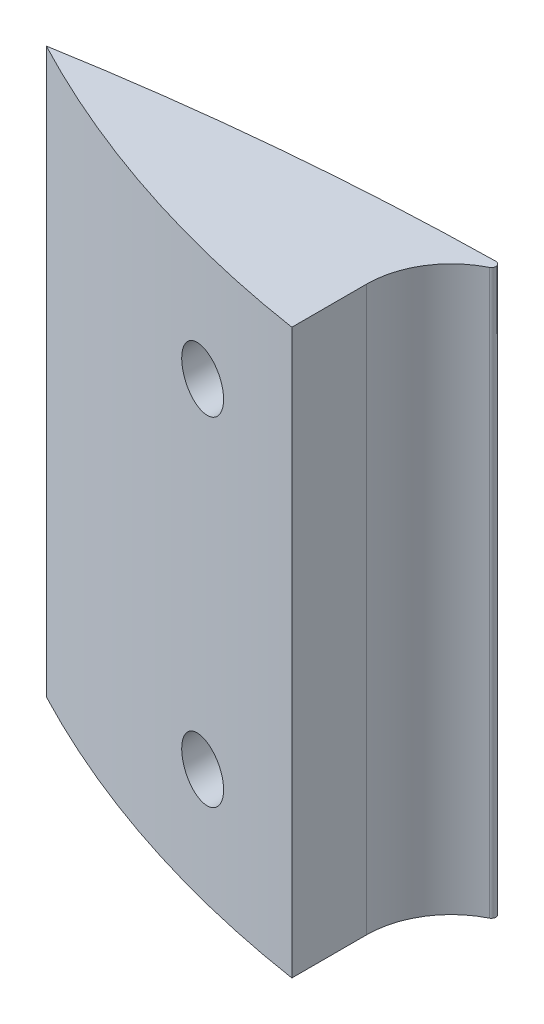
ISO-10303-21;
HEADER;
FILE_DESCRIPTION(('STEP AP214'),'2;1');
FILE_NAME('part.step','',(''),(''),'','','');
FILE_SCHEMA(('AUTOMOTIVE_DESIGN { 1 0 10303 214 1 1 1 1 }'));
ENDSEC;
DATA;
#1=APPLICATION_CONTEXT('core data for automotive mechanical design processes');
#2=APPLICATION_PROTOCOL_DEFINITION('international standard','automotive_design',2000,#1);
#3=PRODUCT_CONTEXT('',#1,'mechanical');
#4=PRODUCT('Part','Part','',(#3));
#5=PRODUCT_RELATED_PRODUCT_CATEGORY('part','',(#4));
#6=PRODUCT_DEFINITION_FORMATION('','',#4);
#7=PRODUCT_DEFINITION_CONTEXT('part definition',#1,'design');
#8=PRODUCT_DEFINITION('design','',#6,#7);
#9=PRODUCT_DEFINITION_SHAPE('','',#8);
#10=(LENGTH_UNIT() NAMED_UNIT(*) SI_UNIT(.MILLI.,.METRE.));
#11=(NAMED_UNIT(*) PLANE_ANGLE_UNIT() SI_UNIT($,.RADIAN.));
#12=(NAMED_UNIT(*) SI_UNIT($,.STERADIAN.) SOLID_ANGLE_UNIT());
#13=UNCERTAINTY_MEASURE_WITH_UNIT(LENGTH_MEASURE(1.E-05),#10,'distance_accuracy_value','');
#14=(GEOMETRIC_REPRESENTATION_CONTEXT(3) GLOBAL_UNCERTAINTY_ASSIGNED_CONTEXT((#13)) GLOBAL_UNIT_ASSIGNED_CONTEXT((#10,
#11,#12)) REPRESENTATION_CONTEXT('',''));
#15=CARTESIAN_POINT('',(0.,0.,0.));
#16=DIRECTION('',(0.,0.,1.));
#17=DIRECTION('',(1.,0.,0.));
#18=AXIS2_PLACEMENT_3D('',#15,#16,#17);
#19=CARTESIAN_POINT('',(-2.23370309297084,31.75,-148.954252747253));
#20=DIRECTION('',(0.,-1.,0.));
#21=DIRECTION('',(0.,0.,-1.));
#22=AXIS2_PLACEMENT_3D('',#19,#20,#21);
#23=CYLINDRICAL_SURFACE('',#22,0.253999999999995);
#24=CARTESIAN_POINT('',(-2.23370309297084,0.,-148.954252747253));
#25=DIRECTION('',(0.,1.,0.));
#26=DIRECTION('',(0.,0.,1.));
#27=AXIS2_PLACEMENT_3D('',#24,#25,#26);
#28=CIRCLE('',#27,0.253999999999995);
#29=CARTESIAN_POINT('',(-2.23751162339361,0.,-149.208224192687));
#30=VERTEX_POINT('',#29);
#31=CARTESIAN_POINT('',(-2.12060420218751,0.,-148.726822228405));
#32=VERTEX_POINT('',#31);
#33=EDGE_CURVE('E119',#30,#32,#28,.F.);
#34=ORIENTED_EDGE('',*,*,#33,.F.);
#35=DIRECTION('',(0.,-1.,0.));
#36=VECTOR('',#35,1.);
#37=CARTESIAN_POINT('',(-2.23751162339361,31.75,-149.208224192687));
#38=LINE('',#37,#36);
#39=CARTESIAN_POINT('',(-2.23751162339361,31.75,-149.208224192687));
#40=VERTEX_POINT('',#39);
#41=EDGE_CURVE('E11',#40,#30,#38,.T.);
#42=ORIENTED_EDGE('',*,*,#41,.F.);
#43=CARTESIAN_POINT('',(-2.23370309297084,31.75,-148.954252747253));
#44=DIRECTION('',(0.,1.,0.));
#45=DIRECTION('',(0.,0.,1.));
#46=AXIS2_PLACEMENT_3D('',#43,#44,#45);
#47=CIRCLE('',#46,0.253999999999995);
#48=CARTESIAN_POINT('',(-2.12060420218751,31.75,-148.726822228405));
#49=VERTEX_POINT('',#48);
#50=EDGE_CURVE('E130',#40,#49,#47,.F.);
#51=ORIENTED_EDGE('',*,*,#50,.T.);
#52=DIRECTION('',(0.,-1.,0.));
#53=VECTOR('',#52,1.);
#54=CARTESIAN_POINT('',(-2.12060420218751,31.75,-148.726822228405));
#55=LINE('',#54,#53);
#56=EDGE_CURVE('E61',#49,#32,#55,.T.);
#57=ORIENTED_EDGE('',*,*,#56,.T.);
#58=EDGE_LOOP('',(#34,#42,#51,#57));
#59=FACE_BOUND('',#58,.T.);
#60=ADVANCED_FACE('F38',(#59),#23,.T.);
#61=CARTESIAN_POINT('',(0.,31.75,0.));
#62=DIRECTION('',(0.,-1.,0.));
#63=DIRECTION('',(0.,0.,-1.));
#64=AXIS2_PLACEMENT_3D('',#61,#62,#63);
#65=CYLINDRICAL_SURFACE('',#64,149.225);
#66=CARTESIAN_POINT('',(-12.7,25.4,-148.683592319395));
#67=CARTESIAN_POINT('',(-12.6999960164895,25.3110613100668,-148.683592731785));
#68=CARTESIAN_POINT('',(-12.6925003578211,25.2220580576522,-148.684233501385));
#69=CARTESIAN_POINT('',(-12.6627077070845,25.0465075600435,-148.686773700128));
#70=CARTESIAN_POINT('',(-12.6403929029256,24.9599634012913,-148.688674643951));
#71=CARTESIAN_POINT('',(-12.5816129719879,24.7919045496928,-148.693659935041));
#72=CARTESIAN_POINT('',(-12.5451557840817,24.7103870648087,-148.696743618363));
#73=CARTESIAN_POINT('',(-12.4591506358712,24.554659898861,-148.703974538911));
#74=CARTESIAN_POINT('',(-12.4096058156383,24.4804484707348,-148.708121521016));
#75=CARTESIAN_POINT('',(-12.2987367819407,24.3412607094112,-148.717331838405));
#76=CARTESIAN_POINT('',(-12.2373911653536,24.276301535418,-148.72239683772));
#77=CARTESIAN_POINT('',(-12.1047239301826,24.1575943518419,-148.733253524956));
#78=CARTESIAN_POINT('',(-12.0334017565161,24.1038469664827,-148.73904525331));
#79=CARTESIAN_POINT('',(-11.8825505835514,24.0089043905248,-148.751172608844));
#80=CARTESIAN_POINT('',(-11.8029951568481,23.9677514103628,-148.757509975765));
#81=CARTESIAN_POINT('',(-11.6381276723458,23.8993881660367,-148.770499227583));
#82=CARTESIAN_POINT('',(-11.5528155344214,23.8721780959838,-148.777151116857));
#83=CARTESIAN_POINT('',(-11.3786206785669,23.8324103114557,-148.790575179587));
#84=CARTESIAN_POINT('',(-11.2897294349641,23.8198900215692,-148.797347615837));
#85=CARTESIAN_POINT('',(-11.1110998446899,23.8099823683153,-148.81079297777));
#86=CARTESIAN_POINT('',(-11.0213614946325,23.8125950654612,-148.817465903054));
#87=CARTESIAN_POINT('',(-10.8435269756261,23.8328931356834,-148.830529474352));
#88=CARTESIAN_POINT('',(-10.7554318687343,23.850587933658,-148.836919941228));
#89=CARTESIAN_POINT('',(-10.5834505677861,23.9005728341597,-148.849248021547));
#90=CARTESIAN_POINT('',(-10.4995643585176,23.932862883931,-148.855185636627));
#91=CARTESIAN_POINT('',(-10.3384986483485,24.0110855077508,-148.86645890759));
#92=CARTESIAN_POINT('',(-10.2613109694812,24.0570011352016,-148.871795299926));
#93=CARTESIAN_POINT('',(-10.1157370356323,24.1611974734049,-148.881757852007));
#94=CARTESIAN_POINT('',(-10.0473506795475,24.2194780420974,-148.886384019911));
#95=CARTESIAN_POINT('',(-9.92148655464047,24.3466117955667,-148.89482431851));
#96=CARTESIAN_POINT('',(-9.86398484978249,24.4154411646991,-148.89864023331));
#97=CARTESIAN_POINT('',(-9.76135495170312,24.5618158879091,-148.905403623862));
#98=CARTESIAN_POINT('',(-9.7162266107262,24.6393611378912,-148.908351109986));
#99=CARTESIAN_POINT('',(-9.63972893967632,24.8007826255233,-148.913322857347));
#100=CARTESIAN_POINT('',(-9.60832960027975,24.8846445803848,-148.915349132588));
#101=CARTESIAN_POINT('',(-9.56004932505922,25.0564650855552,-148.918456452651));
#102=CARTESIAN_POINT('',(-9.54316825617883,25.1444235983123,-148.919537506136));
#103=CARTESIAN_POINT('',(-9.524424592408,25.3218023809712,-148.920737478553));
#104=CARTESIAN_POINT('',(-9.52254006082342,25.4112203239668,-148.920857802826));
#105=CARTESIAN_POINT('',(-9.53378582502585,25.5891028107723,-148.920138273511));
#106=CARTESIAN_POINT('',(-9.54691605935787,25.6775673584828,-148.919298423853));
#107=CARTESIAN_POINT('',(-9.58780555085147,25.8509959365089,-148.916671413411));
#108=CARTESIAN_POINT('',(-9.61555896730573,25.9359613498309,-148.914884630844));
#109=CARTESIAN_POINT('',(-9.6848948820682,26.1000219885918,-148.910391296533));
#110=CARTESIAN_POINT('',(-9.726477401898,26.179117204895,-148.907684743357));
#111=CARTESIAN_POINT('',(-9.82231636209529,26.3292578085678,-148.901393631298));
#112=CARTESIAN_POINT('',(-9.87658208429901,26.4002972437261,-148.897808429307));
#113=CARTESIAN_POINT('',(-9.99621968447313,26.5322572059918,-148.889824372772));
#114=CARTESIAN_POINT('',(-10.0615916511138,26.5931776523033,-148.885425511731));
#115=CARTESIAN_POINT('',(-10.2017015600812,26.7032861464014,-148.875890726996));
#116=CARTESIAN_POINT('',(-10.2764555039488,26.7524537225786,-148.870753541817));
#117=CARTESIAN_POINT('',(-10.433113231392,26.8375450376541,-148.859856679568));
#118=CARTESIAN_POINT('',(-10.5150170940812,26.873468629985,-148.85409699561));
#119=CARTESIAN_POINT('',(-10.6838483059351,26.9311399674858,-148.842074638762));
#120=CARTESIAN_POINT('',(-10.7707867454839,26.9528550118687,-148.83581084258));
#121=CARTESIAN_POINT('',(-10.947051849844,26.9813773199184,-148.822950135066));
#122=CARTESIAN_POINT('',(-11.0363785499507,26.9881843631406,-148.816353218809));
#123=CARTESIAN_POINT('',(-11.2150787625173,26.9867054055736,-148.802992838372));
#124=CARTESIAN_POINT('',(-11.3044519967225,26.9783884911321,-148.796229061007));
#125=CARTESIAN_POINT('',(-11.4805300067264,26.9468387255381,-148.782747170686));
#126=CARTESIAN_POINT('',(-11.5672347573472,26.9236057336926,-148.776029058162));
#127=CARTESIAN_POINT('',(-11.7355840517839,26.8628523054466,-148.762844260204));
#128=CARTESIAN_POINT('',(-11.8172245622235,26.8253206466449,-148.756377776668));
#129=CARTESIAN_POINT('',(-11.9730431483299,26.7370265426733,-148.743917453881));
#130=CARTESIAN_POINT('',(-12.0472215416076,26.6862646609533,-148.737923594514));
#131=CARTESIAN_POINT('',(-12.1859044859718,26.5730146787027,-148.72662572677));
#132=CARTESIAN_POINT('',(-12.2504217914017,26.5105422880527,-148.721320810116));
#133=CARTESIAN_POINT('',(-12.3680614869332,26.375569596773,-148.711583860971));
#134=CARTESIAN_POINT('',(-12.4211812052949,26.3030669514605,-148.707152033162));
#135=CARTESIAN_POINT('',(-12.5143509644851,26.1503054768677,-148.699340389896));
#136=CARTESIAN_POINT('',(-12.5544329100226,26.070066213915,-148.695958007294));
#137=CARTESIAN_POINT('',(-12.6205066518632,25.9040213532925,-148.690364674327));
#138=CARTESIAN_POINT('',(-12.6465157120108,25.8182227209722,-148.688152288749));
#139=CARTESIAN_POINT('',(-12.6767151589905,25.6765558265919,-148.68557980712));
#140=CARTESIAN_POINT('',(-12.6854358477429,25.6216189917021,-148.684835733336));
#141=CARTESIAN_POINT('',(-12.6970795068442,25.5111298408232,-148.683841861138));
#142=CARTESIAN_POINT('',(-12.700002489284,25.4555775261179,-148.683592061693));
#143=CARTESIAN_POINT('',(-12.7,25.4,-148.683592319395));
#144=B_SPLINE_CURVE_WITH_KNOTS('',3,(#66,#67,#68,#69,#70,#71,#72,#73,#74,#75,#76,#77,#78,#79,
#80,#81,#82,#83,#84,#85,#86,#87,#88,#89,#90,#91,#92,#93,#94,#95,#96,#97,#98,#99,#100,#101,#102,
#103,#104,#105,#106,#107,#108,#109,#110,#111,#112,#113,#114,#115,#116,#117,#118,#119,#120,#121,
#122,#123,#124,#125,#126,#127,#128,#129,#130,#131,#132,#133,#134,#135,#136,#137,#138,#139,#140,
#141,#142,#143),.UNSPECIFIED.,.T.,.F.,(4,2,2,2,2,2,2,2,2,2,2,2,2,2,2,2,2,2,2,2,2,2,2,2,2,2,2,2,
2,2,2,2,2,2,2,2,2,2,4),(0.,0.266612806593436,0.533546653801418,0.800330873168733,
1.06705114194267,1.33425980209982,1.60148333531149,1.86959290641726,2.13770621000229,
2.40650110248235,2.67529706981261,2.94426113266399,3.21322422333127,3.48185418748935,
3.75048106554259,4.01851017319166,4.28653608005301,4.55397316161735,4.82140779215949,
5.08845115157303,5.35549341798988,5.62242910468377,5.88936520679901,6.15649727348155,
6.42363147299801,6.6912276409137,6.95882677015251,7.227039629007,7.49525645389786,
7.76402213536554,8.03279035195186,8.30176994903528,8.57073809266259,8.83934795951531,
9.10802072332378,9.37603098386935,9.64371171437285,9.81031762159361,9.97692318136682),.UNSPECIFIED.);
#145=CARTESIAN_POINT('',(-12.7,25.4,-148.683592319395));
#146=VERTEX_POINT('',#145);
#147=EDGE_CURVE('E122',#146,#146,#144,.T.);
#148=ORIENTED_EDGE('',*,*,#147,.T.);
#149=EDGE_LOOP('',(#148));
#150=FACE_BOUND('',#149,.T.);
#151=CARTESIAN_POINT('',(-12.7,6.35,-148.683592319395));
#152=CARTESIAN_POINT('',(-12.6999960164895,6.26106131006681,-148.683592731785));
#153=CARTESIAN_POINT('',(-12.6925003578211,6.17205805765219,-148.684233501385));
#154=CARTESIAN_POINT('',(-12.6627077070845,5.99650756004353,-148.686773700128));
#155=CARTESIAN_POINT('',(-12.6403929029256,5.90996340129129,-148.688674643951));
#156=CARTESIAN_POINT('',(-12.5816129719879,5.74190454969284,-148.693659935041));
#157=CARTESIAN_POINT('',(-12.5451557840818,5.66038706480871,-148.696743618363));
#158=CARTESIAN_POINT('',(-12.4591506358712,5.50465989886105,-148.703974538911));
#159=CARTESIAN_POINT('',(-12.4096058156383,5.43044847073478,-148.708121521016));
#160=CARTESIAN_POINT('',(-12.2987367819407,5.29126070941116,-148.717331838405));
#161=CARTESIAN_POINT('',(-12.2373911653537,5.22630153541805,-148.72239683772));
#162=CARTESIAN_POINT('',(-12.1047239301826,5.10759435184187,-148.733253524956));
#163=CARTESIAN_POINT('',(-12.0334017565162,5.05384696648272,-148.73904525331));
#164=CARTESIAN_POINT('',(-11.8825505835514,4.95890439052475,-148.751172608844));
#165=CARTESIAN_POINT('',(-11.8029951568481,4.91775141036276,-148.757509975765));
#166=CARTESIAN_POINT('',(-11.6381276723458,4.84938816603672,-148.770499227583));
#167=CARTESIAN_POINT('',(-11.5528155344215,4.82217809598376,-148.777151116857));
#168=CARTESIAN_POINT('',(-11.3786206785669,4.78241031145566,-148.790575179587));
#169=CARTESIAN_POINT('',(-11.2897294349641,4.76989002156916,-148.797347615837));
#170=CARTESIAN_POINT('',(-11.1110998446899,4.75998236831525,-148.81079297777));
#171=CARTESIAN_POINT('',(-11.0213614946325,4.76259506546121,-148.817465903054));
#172=CARTESIAN_POINT('',(-10.8435269756261,4.78289313568342,-148.830529474352));
#173=CARTESIAN_POINT('',(-10.7554318687343,4.80058793365802,-148.836919941228));
#174=CARTESIAN_POINT('',(-10.5834505677861,4.85057283415965,-148.849248021547));
#175=CARTESIAN_POINT('',(-10.4995643585176,4.88286288393099,-148.855185636627));
#176=CARTESIAN_POINT('',(-10.3384986483485,4.96108550775075,-148.86645890759));
#177=CARTESIAN_POINT('',(-10.2613109694812,5.00700113520161,-148.871795299926));
#178=CARTESIAN_POINT('',(-10.1157370356324,5.11119747340494,-148.881757852007));
#179=CARTESIAN_POINT('',(-10.0473506795475,5.16947804209742,-148.886384019911));
#180=CARTESIAN_POINT('',(-9.92148655464047,5.29661179556674,-148.89482431851));
#181=CARTESIAN_POINT('',(-9.86398484978249,5.36544116469908,-148.89864023331));
#182=CARTESIAN_POINT('',(-9.76135495170313,5.51181588790912,-148.905403623862));
#183=CARTESIAN_POINT('',(-9.7162266107262,5.58936113789122,-148.908351109986));
#184=CARTESIAN_POINT('',(-9.63972893967633,5.75078262552332,-148.913322857347));
#185=CARTESIAN_POINT('',(-9.60832960027975,5.83464458038483,-148.915349132588));
#186=CARTESIAN_POINT('',(-9.56004932505922,6.00646508555521,-148.918456452651));
#187=CARTESIAN_POINT('',(-9.54316825617883,6.09442359831235,-148.919537506136));
#188=CARTESIAN_POINT('',(-9.524424592408,6.27180238097119,-148.920737478553));
#189=CARTESIAN_POINT('',(-9.52254006082342,6.36122032396683,-148.920857802826));
#190=CARTESIAN_POINT('',(-9.53378582502585,6.53910281077227,-148.920138273511));
#191=CARTESIAN_POINT('',(-9.54691605935787,6.62756735848279,-148.919298423853));
#192=CARTESIAN_POINT('',(-9.58780555085147,6.80099593650894,-148.916671413411));
#193=CARTESIAN_POINT('',(-9.61555896730573,6.88596134983087,-148.914884630844));
#194=CARTESIAN_POINT('',(-9.6848948820682,7.05002198859176,-148.910391296533));
#195=CARTESIAN_POINT('',(-9.726477401898,7.12911720489498,-148.907684743357));
#196=CARTESIAN_POINT('',(-9.82231636209529,7.27925780856782,-148.901393631298));
#197=CARTESIAN_POINT('',(-9.87658208429901,7.35029724372614,-148.897808429307));
#198=CARTESIAN_POINT('',(-9.99621968447313,7.48225720599178,-148.889824372772));
#199=CARTESIAN_POINT('',(-10.0615916511138,7.54317765230325,-148.885425511731));
#200=CARTESIAN_POINT('',(-10.2017015600812,7.65328614640137,-148.875890726996));
#201=CARTESIAN_POINT('',(-10.2764555039488,7.70245372257855,-148.870753541817));
#202=CARTESIAN_POINT('',(-10.433113231392,7.78754503765409,-148.859856679568));
#203=CARTESIAN_POINT('',(-10.5150170940812,7.82346862998497,-148.85409699561));
#204=CARTESIAN_POINT('',(-10.6838483059351,7.8811399674858,-148.842074638762));
#205=CARTESIAN_POINT('',(-10.7707867454839,7.90285501186871,-148.83581084258));
#206=CARTESIAN_POINT('',(-10.947051849844,7.9313773199184,-148.822950135066));
#207=CARTESIAN_POINT('',(-11.0363785499507,7.93818436314058,-148.816353218809));
#208=CARTESIAN_POINT('',(-11.2150787625173,7.93670540557363,-148.802992838372));
#209=CARTESIAN_POINT('',(-11.3044519967225,7.92838849113207,-148.796229061007));
#210=CARTESIAN_POINT('',(-11.4805300067264,7.89683872553809,-148.782747170686));
#211=CARTESIAN_POINT('',(-11.5672347573472,7.87360573369259,-148.776029058162));
#212=CARTESIAN_POINT('',(-11.7355840517839,7.81285230544656,-148.762844260204));
#213=CARTESIAN_POINT('',(-11.8172245622235,7.7753206466449,-148.756377776668));
#214=CARTESIAN_POINT('',(-11.9730431483299,7.68702654267332,-148.743917453881));
#215=CARTESIAN_POINT('',(-12.0472215416076,7.63626466095331,-148.737923594514));
#216=CARTESIAN_POINT('',(-12.1859044859718,7.52301467870266,-148.72662572677));
#217=CARTESIAN_POINT('',(-12.2504217914018,7.46054228805267,-148.721320810116));
#218=CARTESIAN_POINT('',(-12.3680614869332,7.32556959677296,-148.711583860971));
#219=CARTESIAN_POINT('',(-12.4211812052949,7.25306695146046,-148.707152033162));
#220=CARTESIAN_POINT('',(-12.5143509644851,7.10030547686768,-148.699340389896));
#221=CARTESIAN_POINT('',(-12.5544329100226,7.02006621391504,-148.695958007294));
#222=CARTESIAN_POINT('',(-12.6205066518632,6.85402135329251,-148.690364674327));
#223=CARTESIAN_POINT('',(-12.6465157120108,6.76822272097218,-148.688152288749));
#224=CARTESIAN_POINT('',(-12.6767151589905,6.62655582659193,-148.68557980712));
#225=CARTESIAN_POINT('',(-12.6854358477429,6.57161899170208,-148.684835733336));
#226=CARTESIAN_POINT('',(-12.6970795068442,6.46112984082317,-148.683841861138));
#227=CARTESIAN_POINT('',(-12.700002489284,6.40557752611791,-148.683592061693));
#228=CARTESIAN_POINT('',(-12.7,6.35,-148.683592319395));
#229=B_SPLINE_CURVE_WITH_KNOTS('',3,(#151,#152,#153,#154,#155,#156,#157,#158,#159,#160,#161,
#162,#163,#164,#165,#166,#167,#168,#169,#170,#171,#172,#173,#174,#175,#176,#177,#178,#179,#180,
#181,#182,#183,#184,#185,#186,#187,#188,#189,#190,#191,#192,#193,#194,#195,#196,#197,#198,#199,
#200,#201,#202,#203,#204,#205,#206,#207,#208,#209,#210,#211,#212,#213,#214,#215,#216,#217,#218,
#219,#220,#221,#222,#223,#224,#225,#226,#227,#228),.UNSPECIFIED.,.T.,.F.,(4,2,2,2,2,2,2,2,2,2,2,
2,2,2,2,2,2,2,2,2,2,2,2,2,2,2,2,2,2,2,2,2,2,2,2,2,2,2,4),(0.,0.266612806593428,
0.533546653801418,0.800330873168733,1.06705114194267,1.33425980209982,1.6014833353115,
1.86959290641726,2.13770621000229,2.40650110248236,2.67529706981262,2.94426113266399,
3.21322422333128,3.48185418748935,3.75048106554259,4.01851017319167,4.28653608005301,
4.55397316161736,4.8214077921595,5.08845115157303,5.35549341798989,5.62242910468377,
5.88936520679902,6.15649727348155,6.42363147299801,6.69122764091371,6.95882677015252,
7.227039629007,7.49525645389787,7.76402213536555,8.03279035195187,8.30176994903529,
8.5707380926626,8.83934795951533,9.10802072332379,9.37603098386936,9.64371171437286,
9.81031762159362,9.97692318136684),.UNSPECIFIED.);
#230=CARTESIAN_POINT('',(-12.7,6.35,-148.683592319395));
#231=VERTEX_POINT('',#230);
#232=EDGE_CURVE('E139',#231,#231,#229,.T.);
#233=ORIENTED_EDGE('',*,*,#232,.T.);
#234=EDGE_LOOP('',(#233));
#235=FACE_BOUND('',#234,.T.);
#236=CARTESIAN_POINT('',(0.,0.,0.));
#237=DIRECTION('',(0.,1.,0.));
#238=DIRECTION('',(0.,0.,1.));
#239=AXIS2_PLACEMENT_3D('',#236,#237,#238);
#240=CIRCLE('',#239,149.225);
#241=CARTESIAN_POINT('',(-25.4,0.,-147.04740944675));
#242=VERTEX_POINT('',#241);
#243=EDGE_CURVE('E121',#30,#242,#240,.T.);
#244=ORIENTED_EDGE('',*,*,#243,.T.);
#245=DIRECTION('',(0.,-1.,0.));
#246=VECTOR('',#245,1.);
#247=CARTESIAN_POINT('',(-25.4,31.75,-147.04740944675));
#248=LINE('',#247,#246);
#249=CARTESIAN_POINT('',(-25.4,31.75,-147.04740944675));
#250=VERTEX_POINT('',#249);
#251=EDGE_CURVE('E52',#250,#242,#248,.T.);
#252=ORIENTED_EDGE('',*,*,#251,.F.);
#253=CARTESIAN_POINT('',(0.,31.75,0.));
#254=DIRECTION('',(0.,1.,0.));
#255=DIRECTION('',(0.,0.,1.));
#256=AXIS2_PLACEMENT_3D('',#253,#254,#255);
#257=CIRCLE('',#256,149.225);
#258=EDGE_CURVE('E100',#40,#250,#257,.T.);
#259=ORIENTED_EDGE('',*,*,#258,.F.);
#260=ORIENTED_EDGE('',*,*,#41,.T.);
#261=EDGE_LOOP('',(#244,#252,#259,#260));
#262=FACE_BOUND('',#261,.T.);
#263=ADVANCED_FACE('F162',(#150,#235,#262),#65,.T.);
#264=CARTESIAN_POINT('',(5.35675243614937,31.75,-205.644198638905));
#265=DIRECTION('',(0.,-1.,0.));
#266=DIRECTION('',(0.,0.,-1.));
#267=AXIS2_PLACEMENT_3D('',#264,#265,#266);
#268=CYLINDRICAL_SURFACE('',#267,66.1782556739638);
#269=CARTESIAN_POINT('',(-12.7,25.4,-141.976976180971));
#270=CARTESIAN_POINT('',(-12.6999957380114,25.4867309205822,-141.976974808637));
#271=CARTESIAN_POINT('',(-12.692863768307,25.5735268057367,-141.974950925327));
#272=CARTESIAN_POINT('',(-12.6645613884638,25.7446794000014,-141.966934413139));
#273=CARTESIAN_POINT('',(-12.6433737266382,25.8290329785206,-141.960936907125));
#274=CARTESIAN_POINT('',(-12.587719062503,25.9927454531191,-141.945232429865));
#275=CARTESIAN_POINT('',(-12.5532697103769,26.072110825449,-141.93553038918));
#276=CARTESIAN_POINT('',(-12.4722314229641,26.2238231307466,-141.912804326159));
#277=CARTESIAN_POINT('',(-12.4256445584409,26.2961712580298,-141.899780870494));
#278=CARTESIAN_POINT('',(-12.3208617512238,26.4332413735193,-141.870642365485));
#279=CARTESIAN_POINT('',(-12.262478962857,26.4978098254826,-141.854477742145));
#280=CARTESIAN_POINT('',(-12.1363577123053,26.6162902395717,-141.81977624719));
#281=CARTESIAN_POINT('',(-12.068617470664,26.6702001700719,-141.801238924421));
#282=CARTESIAN_POINT('',(-11.9231186358953,26.7678441271238,-141.761701411743));
#283=CARTESIAN_POINT('',(-11.845090271568,26.8111503396506,-141.740637264163));
#284=CARTESIAN_POINT('',(-11.6831839252929,26.8840355557465,-141.697274436263));
#285=CARTESIAN_POINT('',(-11.5993049551885,26.9136122339329,-141.674975547529));
#286=CARTESIAN_POINT('',(-11.4253895169529,26.9590284122837,-141.629125788987));
#287=CARTESIAN_POINT('',(-11.3352441930469,26.9744342647184,-141.605557402944));
#288=CARTESIAN_POINT('',(-11.1536237763668,26.9895819639045,-141.558491939456));
#289=CARTESIAN_POINT('',(-11.0621485679219,26.9893224398649,-141.534994868431));
#290=CARTESIAN_POINT('',(-10.8794075299267,26.9730003661019,-141.488469203683));
#291=CARTESIAN_POINT('',(-10.7881550735563,26.956764003749,-141.465448607026));
#292=CARTESIAN_POINT('',(-10.6095452758283,26.9085582122953,-141.420781261487));
#293=CARTESIAN_POINT('',(-10.5221878222968,26.8765892366043,-141.399134473032));
#294=CARTESIAN_POINT('',(-10.3549053721116,26.7980886966779,-141.358020646901));
#295=CARTESIAN_POINT('',(-10.274911303049,26.7517153716225,-141.338532904073));
#296=CARTESIAN_POINT('',(-10.1238199607735,26.645469162471,-141.301992806397));
#297=CARTESIAN_POINT('',(-10.0527215209959,26.5855980513535,-141.284940132174));
#298=CARTESIAN_POINT('',(-9.92339284335688,26.455639047646,-141.254113964748));
#299=CARTESIAN_POINT('',(-9.86488509825783,26.3858443327454,-141.240269087743));
#300=CARTESIAN_POINT('',(-9.76046302135135,26.2369104785245,-141.215678491483));
#301=CARTESIAN_POINT('',(-9.71454665142014,26.1577728544798,-141.204932270644));
#302=CARTESIAN_POINT('',(-9.63794117196749,25.9947451575506,-141.187064048205));
#303=CARTESIAN_POINT('',(-9.60686871435347,25.9110451396401,-141.179850669146));
#304=CARTESIAN_POINT('',(-9.5591544787887,25.7394170263594,-141.168793627684));
#305=CARTESIAN_POINT('',(-9.54251088748958,25.6514894637526,-141.164949541845));
#306=CARTESIAN_POINT('',(-9.52439547853295,25.4757299056117,-141.160766301816));
#307=CARTESIAN_POINT('',(-9.52263626690645,25.3879289947252,-141.160360754525));
#308=CARTESIAN_POINT('',(-9.53359268183013,25.2132871407889,-141.162889896628));
#309=CARTESIAN_POINT('',(-9.54630754207432,25.1264461471636,-141.165824409187));
#310=CARTESIAN_POINT('',(-9.58568514519504,24.9566640601398,-141.174938645713));
#311=CARTESIAN_POINT('',(-9.61227247372725,24.8737044974254,-141.181100823943));
#312=CARTESIAN_POINT('',(-9.67849705411405,24.7134820229741,-141.196514849199));
#313=CARTESIAN_POINT('',(-9.71813465113402,24.6362192619777,-141.205766777946));
#314=CARTESIAN_POINT('',(-9.80966891827751,24.4887413004204,-141.227248928252));
#315=CARTESIAN_POINT('',(-9.86168081583787,24.4186017635256,-141.239507179438));
#316=CARTESIAN_POINT('',(-9.9761624244685,24.2880498170568,-141.266666073854));
#317=CARTESIAN_POINT('',(-10.0386331219884,24.2276383260649,-141.28156696634));
#318=CARTESIAN_POINT('',(-10.1736712251364,24.1168200348419,-141.314016129249));
#319=CARTESIAN_POINT('',(-10.2464294201313,24.0666606809878,-141.331615131186));
#320=CARTESIAN_POINT('',(-10.3988530412582,23.9792301165607,-141.368786777089));
#321=CARTESIAN_POINT('',(-10.4785193935667,23.9419606374846,-141.388359685754));
#322=CARTESIAN_POINT('',(-10.6448076984057,23.8802973545559,-141.429565375516));
#323=CARTESIAN_POINT('',(-10.7315603181405,23.8562837152897,-141.451239862197));
#324=CARTESIAN_POINT('',(-10.9076175618224,23.8232295527261,-141.495620823105));
#325=CARTESIAN_POINT('',(-10.9969225415666,23.8141911274192,-141.518327441474));
#326=CARTESIAN_POINT('',(-11.1777315424808,23.8112074085932,-141.564706840229));
#327=CARTESIAN_POINT('',(-11.2692388943717,23.8176140782168,-141.588389830339));
#328=CARTESIAN_POINT('',(-11.4498526880684,23.846066660549,-141.635540906243));
#329=CARTESIAN_POINT('',(-11.5389589303762,23.8681138686292,-141.659008974074));
#330=CARTESIAN_POINT('',(-11.712936118268,23.9275372765978,-141.705200970245));
#331=CARTESIAN_POINT('',(-11.7977691908122,23.9650301441217,-141.727917781599));
#332=CARTESIAN_POINT('',(-11.9599507839235,24.0544313326149,-141.771666395294));
#333=CARTESIAN_POINT('',(-12.037299901302,24.106338502829,-141.792698331974));
#334=CARTESIAN_POINT('',(-12.1810485430206,24.2223887842084,-141.83203253698));
#335=CARTESIAN_POINT('',(-12.2475918367737,24.2863415637624,-141.850370270976));
#336=CARTESIAN_POINT('',(-12.3689275486804,24.4252954342025,-141.883977748714));
#337=CARTESIAN_POINT('',(-12.4237191129596,24.5002973272438,-141.899247269517));
#338=CARTESIAN_POINT('',(-12.5180627040927,24.6566171098352,-141.92563903638));
#339=CARTESIAN_POINT('',(-12.5580497747686,24.7376527723477,-141.93687930084));
#340=CARTESIAN_POINT('',(-12.6237540918001,24.9056554121291,-141.955392028005));
#341=CARTESIAN_POINT('',(-12.6494930939791,24.9926131175402,-141.962670539748));
#342=CARTESIAN_POINT('',(-12.6783943790223,25.1335433392603,-141.970851649283));
#343=CARTESIAN_POINT('',(-12.686484280623,25.1864756813106,-141.973144269036));
#344=CARTESIAN_POINT('',(-12.6972883547725,25.2929304355627,-141.976206943787));
#345=CARTESIAN_POINT('',(-12.7000026313269,25.3464528363282,-141.976977028242));
#346=CARTESIAN_POINT('',(-12.7,25.4,-141.976976180971));
#347=B_SPLINE_CURVE_WITH_KNOTS('',3,(#269,#270,#271,#272,#273,#274,#275,#276,#277,#278,#279,
#280,#281,#282,#283,#284,#285,#286,#287,#288,#289,#290,#291,#292,#293,#294,#295,#296,#297,#298,
#299,#300,#301,#302,#303,#304,#305,#306,#307,#308,#309,#310,#311,#312,#313,#314,#315,#316,#317,
#318,#319,#320,#321,#322,#323,#324,#325,#326,#327,#328,#329,#330,#331,#332,#333,#334,#335,#336,
#337,#338,#339,#340,#341,#342,#343,#344,#345,#346),.UNSPECIFIED.,.T.,.F.,(4,2,2,2,2,2,2,2,2,2,2,
2,2,2,2,2,2,2,2,2,2,2,2,2,2,2,2,2,2,2,2,2,2,2,2,2,2,2,4),(0.,0.259992941995481,
0.520305586209556,0.780272967539503,1.04019602521749,1.30461449352335,1.56908331426104,
1.84291488420883,2.11679281633073,2.39879722016067,2.68082630068374,2.96595789300285,
3.25108126838607,3.53317702846359,3.81523575589959,4.09023578410817,4.36519127267191,
4.63260014420022,4.89997540423413,5.16217599807892,5.42436271078876,5.68513873404465,
5.94592165509615,6.2092351675266,6.47257352907967,6.74166587712865,7.01079435832856,
7.28728596585377,7.56381630589833,7.8467075531412,8.12962223257693,8.41471425237379,
8.69978351860253,8.98067787471167,9.261592633545,9.53343455984565,9.80486024906836,
9.96538147826934,10.1258996017378),.UNSPECIFIED.);
#348=CARTESIAN_POINT('',(-12.7,25.4,-141.976976180971));
#349=VERTEX_POINT('',#348);
#350=EDGE_CURVE('E41',#349,#349,#347,.T.);
#351=ORIENTED_EDGE('',*,*,#350,.T.);
#352=EDGE_LOOP('',(#351));
#353=FACE_BOUND('',#352,.T.);
#354=CARTESIAN_POINT('',(-12.7,6.35,-141.976976180971));
#355=CARTESIAN_POINT('',(-12.6999957380114,6.43673092058221,-141.976974808637));
#356=CARTESIAN_POINT('',(-12.692863768307,6.52352680573667,-141.974950925327));
#357=CARTESIAN_POINT('',(-12.6645613884638,6.69467940000135,-141.966934413139));
#358=CARTESIAN_POINT('',(-12.6433737266383,6.77903297852061,-141.960936907125));
#359=CARTESIAN_POINT('',(-12.587719062503,6.94274545311909,-141.945232429865));
#360=CARTESIAN_POINT('',(-12.5532697103769,7.02211082544902,-141.93553038918));
#361=CARTESIAN_POINT('',(-12.4722314229641,7.17382313074656,-141.912804326159));
#362=CARTESIAN_POINT('',(-12.4256445584409,7.24617125802976,-141.899780870494));
#363=CARTESIAN_POINT('',(-12.3208617512238,7.38324137351934,-141.870642365485));
#364=CARTESIAN_POINT('',(-12.262478962857,7.44780982548264,-141.854477742145));
#365=CARTESIAN_POINT('',(-12.1363577123053,7.56629023957166,-141.81977624719));
#366=CARTESIAN_POINT('',(-12.068617470664,7.62020017007194,-141.801238924421));
#367=CARTESIAN_POINT('',(-11.9231186358954,7.71784412712377,-141.761701411743));
#368=CARTESIAN_POINT('',(-11.845090271568,7.76115033965056,-141.740637264163));
#369=CARTESIAN_POINT('',(-11.6831839252929,7.83403555574647,-141.697274436263));
#370=CARTESIAN_POINT('',(-11.5993049551885,7.86361223393292,-141.674975547529));
#371=CARTESIAN_POINT('',(-11.4253895169529,7.90902841228372,-141.629125788987));
#372=CARTESIAN_POINT('',(-11.335244193047,7.92443426471837,-141.605557402944));
#373=CARTESIAN_POINT('',(-11.1536237763668,7.93958196390451,-141.558491939456));
#374=CARTESIAN_POINT('',(-11.0621485679219,7.93932243986491,-141.534994868431));
#375=CARTESIAN_POINT('',(-10.8794075299267,7.92300036610194,-141.488469203683));
#376=CARTESIAN_POINT('',(-10.7881550735563,7.90676400374897,-141.465448607026));
#377=CARTESIAN_POINT('',(-10.6095452758283,7.85855821229528,-141.420781261487));
#378=CARTESIAN_POINT('',(-10.5221878222968,7.82658923660431,-141.399134473032));
#379=CARTESIAN_POINT('',(-10.3549053721116,7.74808869667786,-141.358020646901));
#380=CARTESIAN_POINT('',(-10.274911303049,7.7017153716225,-141.338532904073));
#381=CARTESIAN_POINT('',(-10.1238199607735,7.59546916247098,-141.301992806397));
#382=CARTESIAN_POINT('',(-10.0527215209959,7.53559805135353,-141.284940132174));
#383=CARTESIAN_POINT('',(-9.92339284335688,7.40563904764601,-141.254113964748));
#384=CARTESIAN_POINT('',(-9.86488509825783,7.33584433274538,-141.240269087743));
#385=CARTESIAN_POINT('',(-9.76046302135135,7.18691047852447,-141.215678491483));
#386=CARTESIAN_POINT('',(-9.71454665142014,7.10777285447976,-141.204932270644));
#387=CARTESIAN_POINT('',(-9.63794117196749,6.94474515755065,-141.187064048205));
#388=CARTESIAN_POINT('',(-9.60686871435348,6.86104513964007,-141.179850669146));
#389=CARTESIAN_POINT('',(-9.5591544787887,6.68941702635943,-141.168793627684));
#390=CARTESIAN_POINT('',(-9.54251088748958,6.60148946375259,-141.164949541845));
#391=CARTESIAN_POINT('',(-9.52439547853295,6.42572990561169,-141.160766301816));
#392=CARTESIAN_POINT('',(-9.52263626690645,6.33792899472519,-141.160360754525));
#393=CARTESIAN_POINT('',(-9.53359268183014,6.16328714078887,-141.162889896628));
#394=CARTESIAN_POINT('',(-9.54630754207432,6.07644614716358,-141.165824409187));
#395=CARTESIAN_POINT('',(-9.58568514519504,5.90666406013978,-141.174938645713));
#396=CARTESIAN_POINT('',(-9.61227247372725,5.82370449742538,-141.181100823943));
#397=CARTESIAN_POINT('',(-9.67849705411406,5.66348202297414,-141.196514849199));
#398=CARTESIAN_POINT('',(-9.71813465113402,5.58621926197765,-141.205766777946));
#399=CARTESIAN_POINT('',(-9.80966891827751,5.43874130042037,-141.227248928252));
#400=CARTESIAN_POINT('',(-9.86168081583788,5.36860176352557,-141.239507179438));
#401=CARTESIAN_POINT('',(-9.9761624244685,5.23804981705684,-141.266666073854));
#402=CARTESIAN_POINT('',(-10.0386331219884,5.17763832606494,-141.28156696634));
#403=CARTESIAN_POINT('',(-10.1736712251364,5.06682003484187,-141.314016129249));
#404=CARTESIAN_POINT('',(-10.2464294201313,5.01666068098782,-141.331615131186));
#405=CARTESIAN_POINT('',(-10.3988530412582,4.92923011656068,-141.368786777089));
#406=CARTESIAN_POINT('',(-10.4785193935667,4.89196063748459,-141.388359685754));
#407=CARTESIAN_POINT('',(-10.6448076984057,4.83029735455588,-141.429565375516));
#408=CARTESIAN_POINT('',(-10.7315603181405,4.80628371528972,-141.451239862197));
#409=CARTESIAN_POINT('',(-10.9076175618225,4.77322955272607,-141.495620823105));
#410=CARTESIAN_POINT('',(-10.9969225415666,4.76419112741922,-141.518327441474));
#411=CARTESIAN_POINT('',(-11.1777315424808,4.76120740859317,-141.564706840229));
#412=CARTESIAN_POINT('',(-11.2692388943717,4.76761407821679,-141.588389830339));
#413=CARTESIAN_POINT('',(-11.4498526880684,4.79606666054895,-141.635540906243));
#414=CARTESIAN_POINT('',(-11.5389589303762,4.81811386862922,-141.659008974074));
#415=CARTESIAN_POINT('',(-11.712936118268,4.87753727659781,-141.705200970245));
#416=CARTESIAN_POINT('',(-11.7977691908123,4.91503014412174,-141.727917781599));
#417=CARTESIAN_POINT('',(-11.9599507839235,5.00443133261488,-141.771666395294));
#418=CARTESIAN_POINT('',(-12.037299901302,5.05633850282901,-141.792698331974));
#419=CARTESIAN_POINT('',(-12.1810485430206,5.17238878420839,-141.83203253698));
#420=CARTESIAN_POINT('',(-12.2475918367737,5.23634156376241,-141.850370270976));
#421=CARTESIAN_POINT('',(-12.3689275486804,5.37529543420252,-141.883977748714));
#422=CARTESIAN_POINT('',(-12.4237191129596,5.45029732724384,-141.899247269517));
#423=CARTESIAN_POINT('',(-12.5180627040927,5.60661710983517,-141.92563903638));
#424=CARTESIAN_POINT('',(-12.5580497747687,5.6876527723477,-141.93687930084));
#425=CARTESIAN_POINT('',(-12.6237540918001,5.85565541212909,-141.955392028005));
#426=CARTESIAN_POINT('',(-12.6494930939791,5.94261311754021,-141.962670539748));
#427=CARTESIAN_POINT('',(-12.6783943790223,6.08354333926034,-141.970851649283));
#428=CARTESIAN_POINT('',(-12.686484280623,6.13647568131056,-141.973144269036));
#429=CARTESIAN_POINT('',(-12.6972883547725,6.24293043556267,-141.976206943787));
#430=CARTESIAN_POINT('',(-12.7000026313269,6.29645283632818,-141.976977028242));
#431=CARTESIAN_POINT('',(-12.7,6.35,-141.976976180971));
#432=B_SPLINE_CURVE_WITH_KNOTS('',3,(#354,#355,#356,#357,#358,#359,#360,#361,#362,#363,#364,
#365,#366,#367,#368,#369,#370,#371,#372,#373,#374,#375,#376,#377,#378,#379,#380,#381,#382,#383,
#384,#385,#386,#387,#388,#389,#390,#391,#392,#393,#394,#395,#396,#397,#398,#399,#400,#401,#402,
#403,#404,#405,#406,#407,#408,#409,#410,#411,#412,#413,#414,#415,#416,#417,#418,#419,#420,#421,
#422,#423,#424,#425,#426,#427,#428,#429,#430,#431),.UNSPECIFIED.,.T.,.F.,(4,2,2,2,2,2,2,2,2,2,2,
2,2,2,2,2,2,2,2,2,2,2,2,2,2,2,2,2,2,2,2,2,2,2,2,2,2,2,4),(0.,0.259992941995476,
0.520305586209557,0.780272967539498,1.04019602521749,1.30461449352335,1.56908331426104,
1.84291488420883,2.11679281633073,2.39879722016067,2.68082630068375,2.96595789300285,
3.25108126838608,3.53317702846359,3.81523575589959,4.09023578410818,4.36519127267191,
4.63260014420023,4.89997540423414,5.16217599807893,5.42436271078877,5.68513873404466,
5.94592165509616,6.20923516752661,6.47257352907968,6.74166587712864,7.01079435832856,
7.28728596585377,7.56381630589833,7.84670755314121,8.12962223257694,8.4147142523738,
8.69978351860254,8.98067787471169,9.26159263354502,9.53343455984566,9.80486024906837,
9.96538147826936,10.1258996017378),.UNSPECIFIED.);
#433=CARTESIAN_POINT('',(-12.7,6.35,-141.976976180971));
#434=VERTEX_POINT('',#433);
#435=EDGE_CURVE('E133',#434,#434,#432,.T.);
#436=ORIENTED_EDGE('',*,*,#435,.T.);
#437=EDGE_LOOP('',(#436));
#438=FACE_BOUND('',#437,.T.);
#439=CARTESIAN_POINT('',(5.35675243614937,0.,-205.644198638905));
#440=DIRECTION('',(0.,1.,0.));
#441=DIRECTION('',(0.,0.,1.));
#442=AXIS2_PLACEMENT_3D('',#439,#440,#441);
#443=CIRCLE('',#442,66.1782556739638);
#444=CARTESIAN_POINT('',(-4.7625,0.,-140.2441814051));
#445=VERTEX_POINT('',#444);
#446=EDGE_CURVE('E109',#242,#445,#443,.T.);
#447=ORIENTED_EDGE('',*,*,#446,.T.);
#448=DIRECTION('',(0.,-1.,0.));
#449=VECTOR('',#448,1.);
#450=CARTESIAN_POINT('',(-4.7625,31.75,-140.2441814051));
#451=LINE('',#450,#449);
#452=CARTESIAN_POINT('',(-4.7625,31.75,-140.2441814051));
#453=VERTEX_POINT('',#452);
#454=EDGE_CURVE('E106',#453,#445,#451,.T.);
#455=ORIENTED_EDGE('',*,*,#454,.F.);
#456=CARTESIAN_POINT('',(5.35675243614937,31.75,-205.644198638905));
#457=DIRECTION('',(0.,1.,0.));
#458=DIRECTION('',(0.,0.,1.));
#459=AXIS2_PLACEMENT_3D('',#456,#457,#458);
#460=CIRCLE('',#459,66.1782556739638);
#461=EDGE_CURVE('E93',#250,#453,#460,.T.);
#462=ORIENTED_EDGE('',*,*,#461,.F.);
#463=ORIENTED_EDGE('',*,*,#251,.T.);
#464=EDGE_LOOP('',(#447,#455,#462,#463));
#465=FACE_BOUND('',#464,.T.);
#466=ADVANCED_FACE('F107',(#353,#438,#465),#268,.T.);
#467=CARTESIAN_POINT('',(-4.7625,31.75,0.));
#468=DIRECTION('',(1.,0.,0.));
#469=DIRECTION('',(0.,0.,-1.));
#470=AXIS2_PLACEMENT_3D('',#467,#468,#469);
#471=PLANE('',#470);
#472=DIRECTION('',(0.,0.,1.));
#473=VECTOR('',#472,1.);
#474=CARTESIAN_POINT('',(-4.7625,0.,0.));
#475=LINE('',#474,#473);
#476=CARTESIAN_POINT('',(-4.7625,0.,-144.4625));
#477=VERTEX_POINT('',#476);
#478=EDGE_CURVE('E125',#477,#445,#475,.T.);
#479=ORIENTED_EDGE('',*,*,#478,.F.);
#480=DIRECTION('',(0.,-1.,0.));
#481=VECTOR('',#480,1.);
#482=CARTESIAN_POINT('',(-4.7625,31.75,-144.4625));
#483=LINE('',#482,#481);
#484=CARTESIAN_POINT('',(-4.7625,31.75,-144.4625));
#485=VERTEX_POINT('',#484);
#486=EDGE_CURVE('E77',#485,#477,#483,.T.);
#487=ORIENTED_EDGE('',*,*,#486,.F.);
#488=DIRECTION('',(0.,0.,1.));
#489=VECTOR('',#488,1.);
#490=CARTESIAN_POINT('',(-4.7625,31.75,0.));
#491=LINE('',#490,#489);
#492=EDGE_CURVE('E99',#485,#453,#491,.T.);
#493=ORIENTED_EDGE('',*,*,#492,.T.);
#494=ORIENTED_EDGE('',*,*,#454,.T.);
#495=EDGE_LOOP('',(#479,#487,#493,#494));
#496=FACE_BOUND('',#495,.T.);
#497=ADVANCED_FACE('F113',(#496),#471,.T.);
#498=CARTESIAN_POINT('',(0.,31.75,-144.4625));
#499=DIRECTION('',(0.,-1.,0.));
#500=DIRECTION('',(0.,0.,-1.));
#501=AXIS2_PLACEMENT_3D('',#498,#499,#500);
#502=CYLINDRICAL_SURFACE('',#501,4.7625);
#503=CARTESIAN_POINT('',(0.,0.,-144.4625));
#504=DIRECTION('',(0.,1.,0.));
#505=DIRECTION('',(0.,0.,1.));
#506=AXIS2_PLACEMENT_3D('',#503,#504,#505);
#507=CIRCLE('',#506,4.7625);
#508=EDGE_CURVE('E127',#32,#477,#507,.T.);
#509=ORIENTED_EDGE('',*,*,#508,.F.);
#510=ORIENTED_EDGE('',*,*,#56,.F.);
#511=CARTESIAN_POINT('',(0.,31.75,-144.4625));
#512=DIRECTION('',(0.,1.,0.));
#513=DIRECTION('',(0.,0.,1.));
#514=AXIS2_PLACEMENT_3D('',#511,#512,#513);
#515=CIRCLE('',#514,4.7625);
#516=EDGE_CURVE('E114',#49,#485,#515,.T.);
#517=ORIENTED_EDGE('',*,*,#516,.T.);
#518=ORIENTED_EDGE('',*,*,#486,.T.);
#519=EDGE_LOOP('',(#509,#510,#517,#518));
#520=FACE_BOUND('',#519,.T.);
#521=ADVANCED_FACE('F179',(#520),#502,.F.);
#522=CARTESIAN_POINT('',(0.,31.75,0.));
#523=DIRECTION('',(0.,1.,0.));
#524=DIRECTION('',(0.,0.,1.));
#525=AXIS2_PLACEMENT_3D('',#522,#523,#524);
#526=PLANE('',#525);
#527=ORIENTED_EDGE('',*,*,#50,.F.);
#528=ORIENTED_EDGE('',*,*,#258,.T.);
#529=ORIENTED_EDGE('',*,*,#461,.T.);
#530=ORIENTED_EDGE('',*,*,#492,.F.);
#531=ORIENTED_EDGE('',*,*,#516,.F.);
#532=EDGE_LOOP('',(#527,#528,#529,#530,#531));
#533=FACE_BOUND('',#532,.T.);
#534=ADVANCED_FACE('F96',(#533),#526,.T.);
#535=CARTESIAN_POINT('',(0.,0.,0.));
#536=DIRECTION('',(0.,1.,0.));
#537=DIRECTION('',(0.,0.,1.));
#538=AXIS2_PLACEMENT_3D('',#535,#536,#537);
#539=PLANE('',#538);
#540=ORIENTED_EDGE('',*,*,#33,.T.);
#541=ORIENTED_EDGE('',*,*,#508,.T.);
#542=ORIENTED_EDGE('',*,*,#478,.T.);
#543=ORIENTED_EDGE('',*,*,#446,.F.);
#544=ORIENTED_EDGE('',*,*,#243,.F.);
#545=EDGE_LOOP('',(#540,#541,#542,#543,#544));
#546=FACE_BOUND('',#545,.T.);
#547=ADVANCED_FACE('F147',(#546),#539,.F.);
#548=CARTESIAN_POINT('',(-11.1125,6.35,-140.2441814051));
#549=DIRECTION('',(0.,0.,-1.));
#550=DIRECTION('',(-1.,0.,0.));
#551=AXIS2_PLACEMENT_3D('',#548,#549,#550);
#552=CYLINDRICAL_SURFACE('',#551,1.5875);
#553=ORIENTED_EDGE('',*,*,#435,.F.);
#554=EDGE_LOOP('',(#553));
#555=FACE_BOUND('',#554,.T.);
#556=ORIENTED_EDGE('',*,*,#232,.F.);
#557=EDGE_LOOP('',(#556));
#558=FACE_BOUND('',#557,.T.);
#559=ADVANCED_FACE('F142',(#555,#558),#552,.F.);
#560=CARTESIAN_POINT('',(-11.1125,25.4,-140.2441814051));
#561=DIRECTION('',(0.,0.,-1.));
#562=DIRECTION('',(-1.,0.,0.));
#563=AXIS2_PLACEMENT_3D('',#560,#561,#562);
#564=CYLINDRICAL_SURFACE('',#563,1.5875);
#565=ORIENTED_EDGE('',*,*,#350,.F.);
#566=EDGE_LOOP('',(#565));
#567=FACE_BOUND('',#566,.T.);
#568=ORIENTED_EDGE('',*,*,#147,.F.);
#569=EDGE_LOOP('',(#568));
#570=FACE_BOUND('',#569,.T.);
#571=ADVANCED_FACE('F146',(#567,#570),#564,.F.);
#572=CLOSED_SHELL('',(#60,#263,#466,#497,#521,#534,#547,#559,#571));
#573=MANIFOLD_SOLID_BREP('B2',#572);
#574=ADVANCED_BREP_SHAPE_REPRESENTATION('',(#18,#573),#14);
#575=SHAPE_DEFINITION_REPRESENTATION(#9,#574);
ENDSEC;
END-ISO-10303-21;
